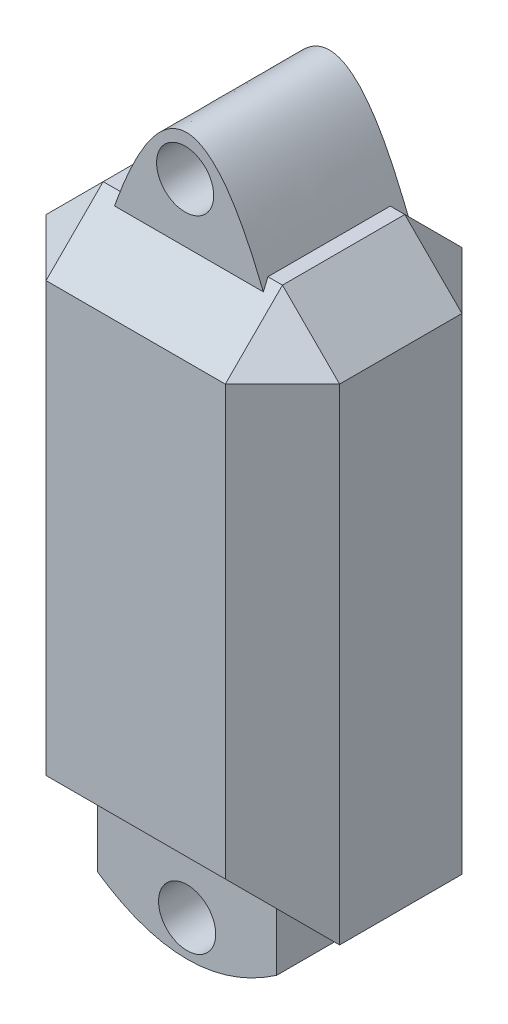
ISO-10303-21;
HEADER;
FILE_DESCRIPTION(('STEP AP214'),'2;1');
FILE_NAME('part.step','',(''),(''),'','','');
FILE_SCHEMA(('AUTOMOTIVE_DESIGN { 1 0 10303 214 1 1 1 1 }'));
ENDSEC;
DATA;
#1=APPLICATION_CONTEXT('core data for automotive mechanical design processes');
#2=APPLICATION_PROTOCOL_DEFINITION('international standard','automotive_design',2000,#1);
#3=PRODUCT_CONTEXT('',#1,'mechanical');
#4=PRODUCT('Part','Part','',(#3));
#5=PRODUCT_RELATED_PRODUCT_CATEGORY('part','',(#4));
#6=PRODUCT_DEFINITION_FORMATION('','',#4);
#7=PRODUCT_DEFINITION_CONTEXT('part definition',#1,'design');
#8=PRODUCT_DEFINITION('design','',#6,#7);
#9=PRODUCT_DEFINITION_SHAPE('','',#8);
#10=(LENGTH_UNIT() NAMED_UNIT(*) SI_UNIT(.MILLI.,.METRE.));
#11=(NAMED_UNIT(*) PLANE_ANGLE_UNIT() SI_UNIT($,.RADIAN.));
#12=(NAMED_UNIT(*) SI_UNIT($,.STERADIAN.) SOLID_ANGLE_UNIT());
#13=UNCERTAINTY_MEASURE_WITH_UNIT(LENGTH_MEASURE(1.E-05),#10,'distance_accuracy_value','');
#14=(GEOMETRIC_REPRESENTATION_CONTEXT(3) GLOBAL_UNCERTAINTY_ASSIGNED_CONTEXT((#13)) GLOBAL_UNIT_ASSIGNED_CONTEXT((#10,
#11,#12)) REPRESENTATION_CONTEXT('',''));
#15=CARTESIAN_POINT('',(0.,0.,0.));
#16=DIRECTION('',(0.,0.,1.));
#17=DIRECTION('',(1.,0.,0.));
#18=AXIS2_PLACEMENT_3D('',#15,#16,#17);
#19=CARTESIAN_POINT('',(0.,0.,0.));
#20=DIRECTION('',(0.,-1.,0.));
#21=DIRECTION('',(0.,0.,-1.));
#22=AXIS2_PLACEMENT_3D('',#19,#20,#21);
#23=PLANE('',#22);
#24=DIRECTION('',(0.,0.,-1.));
#25=VECTOR('',#24,1.);
#26=CARTESIAN_POINT('',(13.1377551020408,0.,25.));
#27=LINE('',#26,#25);
#28=CARTESIAN_POINT('',(13.1377551020408,0.,23.6525623301883));
#29=VERTEX_POINT('',#28);
#30=CARTESIAN_POINT('',(13.1377551020408,0.,2.24150356803531));
#31=VERTEX_POINT('',#30);
#32=EDGE_CURVE('E210',#29,#31,#27,.T.);
#33=ORIENTED_EDGE('',*,*,#32,.F.);
#34=DIRECTION('',(1.,0.,0.));
#35=VECTOR('',#34,1.);
#36=CARTESIAN_POINT('',(0.,0.,23.6525623301883));
#37=LINE('',#36,#35);
#38=CARTESIAN_POINT('',(15.6857053904163,0.,23.6525623301883));
#39=VERTEX_POINT('',#38);
#40=EDGE_CURVE('E432',#29,#39,#37,.T.);
#41=ORIENTED_EDGE('',*,*,#40,.T.);
#42=DIRECTION('',(0.,0.,-1.));
#43=VECTOR('',#42,1.);
#44=CARTESIAN_POINT('',(15.6857053904163,0.,0.));
#45=LINE('',#44,#43);
#46=CARTESIAN_POINT('',(15.6857053904163,0.,2.24150356803531));
#47=VERTEX_POINT('',#46);
#48=EDGE_CURVE('E444',#39,#47,#45,.T.);
#49=ORIENTED_EDGE('',*,*,#48,.T.);
#50=DIRECTION('',(-1.,0.,0.));
#51=VECTOR('',#50,1.);
#52=CARTESIAN_POINT('',(0.,0.,2.24150356803531));
#53=LINE('',#52,#51);
#54=EDGE_CURVE('E435',#47,#31,#53,.T.);
#55=ORIENTED_EDGE('',*,*,#54,.T.);
#56=EDGE_LOOP('',(#33,#41,#49,#55));
#57=FACE_BOUND('',#56,.T.);
#58=ADVANCED_FACE('F36',(#57),#23,.F.);
#59=CARTESIAN_POINT('',(0.,-95.,0.));
#60=DIRECTION('',(0.,-1.,0.));
#61=DIRECTION('',(0.,0.,-1.));
#62=AXIS2_PLACEMENT_3D('',#59,#60,#61);
#63=PLANE('',#62);
#64=DIRECTION('',(0.,0.,-1.));
#65=VECTOR('',#64,1.);
#66=CARTESIAN_POINT('',(-25.6857053904163,-95.,33.6525623301883));
#67=LINE('',#66,#65);
#68=CARTESIAN_POINT('',(-25.6857053904163,-95.,23.6525623301883));
#69=VERTEX_POINT('',#68);
#70=CARTESIAN_POINT('',(-25.6857053904163,-95.,2.24150356803531));
#71=VERTEX_POINT('',#70);
#72=EDGE_CURVE('E216',#69,#71,#67,.T.);
#73=ORIENTED_EDGE('',*,*,#72,.T.);
#74=DIRECTION('',(1.,0.,0.));
#75=VECTOR('',#74,1.);
#76=CARTESIAN_POINT('',(25.6857053904163,-95.,2.24150356803531));
#77=LINE('',#76,#75);
#78=CARTESIAN_POINT('',(-15.6857053904163,-95.,2.24150356803532));
#79=VERTEX_POINT('',#78);
#80=EDGE_CURVE('E508',#71,#79,#77,.T.);
#81=ORIENTED_EDGE('',*,*,#80,.T.);
#82=DIRECTION('',(0.,0.,-1.));
#83=VECTOR('',#82,1.);
#84=CARTESIAN_POINT('',(-15.6857053904163,-95.,116.241503568035));
#85=LINE('',#84,#83);
#86=CARTESIAN_POINT('',(-15.6857053904163,-95.,23.6525623301883));
#87=VERTEX_POINT('',#86);
#88=EDGE_CURVE('E357',#87,#79,#85,.T.);
#89=ORIENTED_EDGE('',*,*,#88,.F.);
#90=DIRECTION('',(-1.,0.,0.));
#91=VECTOR('',#90,1.);
#92=CARTESIAN_POINT('',(-25.6857053904163,-95.,23.6525623301883));
#93=LINE('',#92,#91);
#94=EDGE_CURVE('E207',#87,#69,#93,.T.);
#95=ORIENTED_EDGE('',*,*,#94,.T.);
#96=EDGE_LOOP('',(#73,#81,#89,#95));
#97=FACE_BOUND('',#96,.T.);
#98=ADVANCED_FACE('F394',(#97),#63,.T.);
#99=CARTESIAN_POINT('',(0.239838107216174,16.0909489745126,25.));
#100=DIRECTION('',(0.,0.,1.));
#101=DIRECTION('',(1.,0.,0.));
#102=AXIS2_PLACEMENT_3D('',#99,#100,#101);
#103=PLANE('',#102);
#104=CARTESIAN_POINT('',(544.971114688013,-1287.27591796101,25.));
#105=CARTESIAN_POINT('',(279.054434895027,-643.637958980505,25.));
#106=CARTESIAN_POINT('',(13.1377551020408,0.,25.));
#107=CARTESIAN_POINT('',(-0.158078887608479,32.1818979490252,25.));
#108=CARTESIAN_POINT('',(-11.8622448979592,0.,25.));
#109=CARTESIAN_POINT('',(-58.678908939362,-128.727591796101,25.));
#110=CARTESIAN_POINT('',(-105.495572980765,-257.455183592202,25.));
#111=B_SPLINE_CURVE_WITH_KNOTS('',2,(#104,#105,#106,#107,#108,#109,#110),.UNSPECIFIED.,.F.,.F.,
(3,2,2,3),(-20.,0.,1.,5.),.UNSPECIFIED.);
#112=CARTESIAN_POINT('',(13.6944440704041,-1.34743766981172,25.));
#113=VERTEX_POINT('',#112);
#114=CARTESIAN_POINT('',(-11.8622448979592,0.,25.));
#115=VERTEX_POINT('',#114);
#116=EDGE_CURVE('E227',#113,#115,#111,.T.);
#117=ORIENTED_EDGE('',*,*,#116,.T.);
#118=CARTESIAN_POINT('',(13.1377551020408,0.,25.));
#119=CARTESIAN_POINT('',(-0.158078887608479,32.1818979490252,25.));
#120=CARTESIAN_POINT('',(-11.8622448979592,0.,25.));
#121=CARTESIAN_POINT('',(-58.678908939362,-128.727591796101,25.));
#122=CARTESIAN_POINT('',(-105.495572980765,-257.455183592202,25.));
#123=B_SPLINE_CURVE_WITH_KNOTS('',2,(#118,#119,#120,#121,#122),.UNSPECIFIED.,.F.,.F.,(3,2,3),
(0.,1.,5.),.UNSPECIFIED.);
#124=CARTESIAN_POINT('',(-12.3522916379326,-1.34743766981172,25.));
#125=VERTEX_POINT('',#124);
#126=EDGE_CURVE('E45',#115,#125,#123,.T.);
#127=ORIENTED_EDGE('',*,*,#126,.T.);
#128=DIRECTION('',(-1.,0.,0.));
#129=VECTOR('',#128,1.);
#130=CARTESIAN_POINT('',(-25.6857053904163,-1.34743766981172,25.));
#131=LINE('',#130,#129);
#132=EDGE_CURVE('E472',#125,#113,#131,.F.);
#133=ORIENTED_EDGE('',*,*,#132,.T.);
#134=EDGE_LOOP('',(#117,#127,#133));
#135=FACE_BOUND('',#134,.T.);
#136=CARTESIAN_POINT('',(0.,8.90150617997449,25.));
#137=DIRECTION('',(0.,0.,1.));
#138=DIRECTION('',(1.,0.,0.));
#139=AXIS2_PLACEMENT_3D('',#136,#137,#138);
#140=CIRCLE('',#139,5.);
#141=CARTESIAN_POINT('',(5.,8.90150617997449,25.));
#142=VERTEX_POINT('',#141);
#143=EDGE_CURVE('E231',#142,#142,#140,.T.);
#144=ORIENTED_EDGE('',*,*,#143,.F.);
#145=EDGE_LOOP('',(#144));
#146=FACE_BOUND('',#145,.T.);
#147=ADVANCED_FACE('F416',(#135,#146),#103,.T.);
#148=CARTESIAN_POINT('',(0.239838107216174,16.0909489745126,0.));
#149=DIRECTION('',(0.,0.,1.));
#150=DIRECTION('',(1.,0.,0.));
#151=AXIS2_PLACEMENT_3D('',#148,#149,#150);
#152=PLANE('',#151);
#153=CARTESIAN_POINT('',(119.504427019235,-257.455183592202,0.));
#154=CARTESIAN_POINT('',(66.3210910606381,-128.727591796101,0.));
#155=CARTESIAN_POINT('',(13.1377551020408,0.,0.));
#156=CARTESIAN_POINT('',(-0.158078887608479,32.1818979490252,0.));
#157=CARTESIAN_POINT('',(-11.8622448979592,0.,0.));
#158=CARTESIAN_POINT('',(-245.945565104973,-643.637958980505,0.));
#159=CARTESIAN_POINT('',(-480.028885311987,-1287.27591796101,0.));
#160=B_SPLINE_CURVE_WITH_KNOTS('',2,(#153,#154,#155,#156,#157,#158,#159),.UNSPECIFIED.,.F.,.F.,
(3,2,2,3),(-4.,0.,1.,21.),.UNSPECIFIED.);
#161=CARTESIAN_POINT('',(13.1377551020408,0.,0.));
#162=VERTEX_POINT('',#161);
#163=CARTESIAN_POINT('',(-12.6774525626728,-2.24150356803531,0.));
#164=VERTEX_POINT('',#163);
#165=EDGE_CURVE('E53',#162,#164,#160,.T.);
#166=ORIENTED_EDGE('',*,*,#165,.F.);
#167=CARTESIAN_POINT('',(119.504427019235,-257.455183592202,0.));
#168=CARTESIAN_POINT('',(66.3210910606381,-128.727591796101,0.));
#169=CARTESIAN_POINT('',(13.1377551020408,0.,0.));
#170=CARTESIAN_POINT('',(-0.158078887608479,32.1818979490252,0.));
#171=CARTESIAN_POINT('',(-11.8622448979592,0.,0.));
#172=B_SPLINE_CURVE_WITH_KNOTS('',2,(#167,#168,#169,#170,#171),.UNSPECIFIED.,.F.,.F.,(3,2,3),
(-4.,0.,1.),.UNSPECIFIED.);
#173=CARTESIAN_POINT('',(14.0638241416919,-2.24150356803531,0.));
#174=VERTEX_POINT('',#173);
#175=EDGE_CURVE('E11',#162,#174,#172,.F.);
#176=ORIENTED_EDGE('',*,*,#175,.T.);
#177=DIRECTION('',(1.,0.,0.));
#178=VECTOR('',#177,1.);
#179=CARTESIAN_POINT('',(0.239838107216174,-2.24150356803531,0.));
#180=LINE('',#179,#178);
#181=EDGE_CURVE('E282',#174,#164,#180,.F.);
#182=ORIENTED_EDGE('',*,*,#181,.T.);
#183=EDGE_LOOP('',(#166,#176,#182));
#184=FACE_BOUND('',#183,.T.);
#185=CARTESIAN_POINT('',(0.,8.90150617997449,0.));
#186=DIRECTION('',(0.,0.,1.));
#187=DIRECTION('',(1.,0.,0.));
#188=AXIS2_PLACEMENT_3D('',#185,#186,#187);
#189=CIRCLE('',#188,5.);
#190=CARTESIAN_POINT('',(5.,8.90150617997449,0.));
#191=VERTEX_POINT('',#190);
#192=EDGE_CURVE('E240',#191,#191,#189,.T.);
#193=ORIENTED_EDGE('',*,*,#192,.T.);
#194=EDGE_LOOP('',(#193));
#195=FACE_BOUND('',#194,.T.);
#196=ADVANCED_FACE('F252',(#184,#195),#152,.F.);
#197=DIRECTION('',(0.,0.,-1.));
#198=VECTOR('',#197,1.);
#199=SURFACE_OF_LINEAR_EXTRUSION('',#111,#198);
#200=ORIENTED_EDGE('',*,*,#165,.T.);
#201=CARTESIAN_POINT('',(-12.6774525626728,-2.24150356803531,0.));
#202=CARTESIAN_POINT('',(-12.405716674435,-1.49433571202354,0.747167856011771));
#203=CARTESIAN_POINT('',(-12.1339807861971,-0.747167856011769,1.49433571202354));
#204=CARTESIAN_POINT('',(-11.8622448979592,0.,2.24150356803531));
#205=B_SPLINE_CURVE_WITH_KNOTS('',3,(#201,#202,#203,#204),.UNSPECIFIED.,.F.,.F.,(4,4),(0.,
3.27310861836847),.UNSPECIFIED.);
#206=CARTESIAN_POINT('',(-11.8622448979592,0.,2.24150356803531));
#207=VERTEX_POINT('',#206);
#208=EDGE_CURVE('E294',#164,#207,#205,.T.);
#209=ORIENTED_EDGE('',*,*,#208,.T.);
#210=DIRECTION('',(0.,0.,-1.));
#211=VECTOR('',#210,1.);
#212=CARTESIAN_POINT('',(-11.8622448979592,0.,25.));
#213=LINE('',#212,#211);
#214=CARTESIAN_POINT('',(-11.8622448979592,0.,23.6525623301883));
#215=VERTEX_POINT('',#214);
#216=EDGE_CURVE('E205',#215,#207,#213,.T.);
#217=ORIENTED_EDGE('',*,*,#216,.F.);
#218=CARTESIAN_POINT('',(-11.8622448979592,0.,23.6525623301883));
#219=CARTESIAN_POINT('',(-12.0255938112836,-0.44914588993724,24.1017082201255));
#220=CARTESIAN_POINT('',(-12.1889427246081,-0.89829177987448,24.5508541100628));
#221=CARTESIAN_POINT('',(-12.3522916379326,-1.34743766981172,25.));
#222=B_SPLINE_CURVE_WITH_KNOTS('',3,(#218,#219,#220,#221),.UNSPECIFIED.,.F.,.F.,(4,4),(0.,
1.96756762410186),.UNSPECIFIED.);
#223=EDGE_CURVE('E259',#215,#125,#222,.T.);
#224=ORIENTED_EDGE('',*,*,#223,.T.);
#225=ORIENTED_EDGE('',*,*,#126,.F.);
#226=ORIENTED_EDGE('',*,*,#116,.F.);
#227=CARTESIAN_POINT('',(13.6944440704041,-1.34743766981172,25.));
#228=CARTESIAN_POINT('',(13.5088810809497,-0.898291779874477,24.5508541100628));
#229=CARTESIAN_POINT('',(13.3233180914953,-0.449145889937239,24.1017082201255));
#230=CARTESIAN_POINT('',(13.1377551020408,0.,23.6525623301883));
#231=B_SPLINE_CURVE_WITH_KNOTS('',3,(#227,#228,#229,#230),.UNSPECIFIED.,.F.,.F.,(4,4),(0.,
1.98521514087332),.UNSPECIFIED.);
#232=EDGE_CURVE('E270',#113,#29,#231,.T.);
#233=ORIENTED_EDGE('',*,*,#232,.T.);
#234=ORIENTED_EDGE('',*,*,#32,.T.);
#235=CARTESIAN_POINT('',(13.1377551020408,0.,2.24150356803531));
#236=CARTESIAN_POINT('',(13.4464447819245,-0.747167856011769,1.49433571202354));
#237=CARTESIAN_POINT('',(13.7551344618082,-1.49433571202354,0.747167856011771));
#238=CARTESIAN_POINT('',(14.0638241416919,-2.24150356803531,0.));
#239=B_SPLINE_CURVE_WITH_KNOTS('',3,(#235,#236,#237,#238),.UNSPECIFIED.,.F.,.F.,(4,4),(0.,
3.30246579955499),.UNSPECIFIED.);
#240=EDGE_CURVE('E59',#31,#174,#239,.T.);
#241=ORIENTED_EDGE('',*,*,#240,.T.);
#242=ORIENTED_EDGE('',*,*,#175,.F.);
#243=EDGE_LOOP('',(#200,#209,#217,#224,#225,#226,#233,#234,#241,#242));
#244=FACE_BOUND('',#243,.T.);
#245=ADVANCED_FACE('F246',(#244),#199,.F.);
#246=CARTESIAN_POINT('',(0.,8.90150617997449,25.));
#247=DIRECTION('',(0.,0.,-1.));
#248=DIRECTION('',(-1.,0.,0.));
#249=AXIS2_PLACEMENT_3D('',#246,#247,#248);
#250=CYLINDRICAL_SURFACE('',#249,5.);
#251=ORIENTED_EDGE('',*,*,#143,.T.);
#252=EDGE_LOOP('',(#251));
#253=FACE_BOUND('',#252,.T.);
#254=ORIENTED_EDGE('',*,*,#192,.F.);
#255=EDGE_LOOP('',(#254));
#256=FACE_BOUND('',#255,.T.);
#257=ADVANCED_FACE('F251',(#253,#256),#250,.F.);
#258=DIRECTION('',(0.,0.,1.));
#259=VECTOR('',#258,1.);
#260=CARTESIAN_POINT('',(-15.6857053904163,0.,0.));
#261=LINE('',#260,#259);
#262=CARTESIAN_POINT('',(-15.6857053904163,0.,2.24150356803531));
#263=VERTEX_POINT('',#262);
#264=CARTESIAN_POINT('',(-15.6857053904163,0.,23.6525623301883));
#265=VERTEX_POINT('',#264);
#266=EDGE_CURVE('E480',#263,#265,#261,.T.);
#267=ORIENTED_EDGE('',*,*,#266,.T.);
#268=DIRECTION('',(1.,0.,0.));
#269=VECTOR('',#268,1.);
#270=CARTESIAN_POINT('',(0.,0.,23.6525623301883));
#271=LINE('',#270,#269);
#272=EDGE_CURVE('E477',#265,#215,#271,.T.);
#273=ORIENTED_EDGE('',*,*,#272,.T.);
#274=ORIENTED_EDGE('',*,*,#216,.T.);
#275=DIRECTION('',(-1.,0.,0.));
#276=VECTOR('',#275,1.);
#277=CARTESIAN_POINT('',(0.,0.,2.24150356803531));
#278=LINE('',#277,#276);
#279=EDGE_CURVE('E481',#207,#263,#278,.T.);
#280=ORIENTED_EDGE('',*,*,#279,.T.);
#281=EDGE_LOOP('',(#267,#273,#274,#280));
#282=FACE_BOUND('',#281,.T.);
#283=ADVANCED_FACE('F395',(#282),#23,.F.);
#284=CARTESIAN_POINT('',(25.6857053904163,-95.,33.6525623301883));
#285=DIRECTION('',(-1.,0.,0.));
#286=DIRECTION('',(0.,0.,1.));
#287=AXIS2_PLACEMENT_3D('',#284,#285,#286);
#288=PLANE('',#287);
#289=DIRECTION('',(0.,0.,1.));
#290=VECTOR('',#289,1.);
#291=CARTESIAN_POINT('',(25.6857053904163,-9.99999999999999,33.6525623301883));
#292=LINE('',#291,#290);
#293=CARTESIAN_POINT('',(25.6857053904163,-9.99999999999999,2.24150356803531));
#294=VERTEX_POINT('',#293);
#295=CARTESIAN_POINT('',(25.6857053904163,-9.99999999999999,23.6525623301883));
#296=VERTEX_POINT('',#295);
#297=EDGE_CURVE('E446',#294,#296,#292,.T.);
#298=ORIENTED_EDGE('',*,*,#297,.T.);
#299=DIRECTION('',(0.,-1.,0.));
#300=VECTOR('',#299,1.);
#301=CARTESIAN_POINT('',(25.6857053904163,-95.,23.6525623301883));
#302=LINE('',#301,#300);
#303=CARTESIAN_POINT('',(25.6857053904163,-95.,23.6525623301883));
#304=VERTEX_POINT('',#303);
#305=EDGE_CURVE('E452',#296,#304,#302,.T.);
#306=ORIENTED_EDGE('',*,*,#305,.T.);
#307=DIRECTION('',(0.,0.,1.));
#308=VECTOR('',#307,1.);
#309=CARTESIAN_POINT('',(25.6857053904163,-95.,33.6525623301883));
#310=LINE('',#309,#308);
#311=CARTESIAN_POINT('',(25.6857053904163,-95.,2.24150356803531));
#312=VERTEX_POINT('',#311);
#313=EDGE_CURVE('E374',#312,#304,#310,.T.);
#314=ORIENTED_EDGE('',*,*,#313,.F.);
#315=DIRECTION('',(0.,1.,0.));
#316=VECTOR('',#315,1.);
#317=CARTESIAN_POINT('',(25.6857053904163,-95.,2.24150356803531));
#318=LINE('',#317,#316);
#319=EDGE_CURVE('E443',#312,#294,#318,.T.);
#320=ORIENTED_EDGE('',*,*,#319,.T.);
#321=EDGE_LOOP('',(#298,#306,#314,#320));
#322=FACE_BOUND('',#321,.T.);
#323=ADVANCED_FACE('F398',(#322),#288,.F.);
#324=CARTESIAN_POINT('',(-25.6857053904163,-95.,33.6525623301883));
#325=DIRECTION('',(0.,0.,-1.));
#326=DIRECTION('',(-1.,0.,0.));
#327=AXIS2_PLACEMENT_3D('',#324,#325,#326);
#328=PLANE('',#327);
#329=DIRECTION('',(1.,0.,0.));
#330=VECTOR('',#329,1.);
#331=CARTESIAN_POINT('',(25.6857053904163,-85.,33.6525623301883));
#332=LINE('',#331,#330);
#333=CARTESIAN_POINT('',(-15.6857053904163,-85.,33.6525623301883));
#334=VERTEX_POINT('',#333);
#335=CARTESIAN_POINT('',(15.6857053904163,-85.,33.6525623301883));
#336=VERTEX_POINT('',#335);
#337=EDGE_CURVE('E492',#334,#336,#332,.T.);
#338=ORIENTED_EDGE('',*,*,#337,.T.);
#339=DIRECTION('',(0.,1.,0.));
#340=VECTOR('',#339,1.);
#341=CARTESIAN_POINT('',(15.6857053904163,-95.,33.6525623301883));
#342=LINE('',#341,#340);
#343=CARTESIAN_POINT('',(15.6857053904163,-9.99999999999999,33.6525623301883));
#344=VERTEX_POINT('',#343);
#345=EDGE_CURVE('E488',#336,#344,#342,.T.);
#346=ORIENTED_EDGE('',*,*,#345,.T.);
#347=DIRECTION('',(-1.,0.,0.));
#348=VECTOR('',#347,1.);
#349=CARTESIAN_POINT('',(-25.6857053904163,-9.99999999999999,33.6525623301883));
#350=LINE('',#349,#348);
#351=CARTESIAN_POINT('',(-15.6857053904163,-9.99999999999999,33.6525623301883));
#352=VERTEX_POINT('',#351);
#353=EDGE_CURVE('E495',#344,#352,#350,.T.);
#354=ORIENTED_EDGE('',*,*,#353,.T.);
#355=DIRECTION('',(0.,-1.,0.));
#356=VECTOR('',#355,1.);
#357=CARTESIAN_POINT('',(-15.6857053904163,-95.,33.6525623301883));
#358=LINE('',#357,#356);
#359=EDGE_CURVE('E497',#352,#334,#358,.T.);
#360=ORIENTED_EDGE('',*,*,#359,.T.);
#361=EDGE_LOOP('',(#338,#346,#354,#360));
#362=FACE_BOUND('',#361,.T.);
#363=ADVANCED_FACE('F406',(#362),#328,.F.);
#364=CARTESIAN_POINT('',(-25.6857053904163,-95.,33.6525623301883));
#365=DIRECTION('',(1.,0.,0.));
#366=DIRECTION('',(0.,0.,-1.));
#367=AXIS2_PLACEMENT_3D('',#364,#365,#366);
#368=PLANE('',#367);
#369=ORIENTED_EDGE('',*,*,#72,.F.);
#370=DIRECTION('',(0.,1.,0.));
#371=VECTOR('',#370,1.);
#372=CARTESIAN_POINT('',(-25.6857053904163,-95.,23.6525623301883));
#373=LINE('',#372,#371);
#374=CARTESIAN_POINT('',(-25.6857053904163,-10.,23.6525623301883));
#375=VERTEX_POINT('',#374);
#376=EDGE_CURVE('E458',#69,#375,#373,.T.);
#377=ORIENTED_EDGE('',*,*,#376,.T.);
#378=DIRECTION('',(0.,0.,-1.));
#379=VECTOR('',#378,1.);
#380=CARTESIAN_POINT('',(-25.6857053904163,-10.,33.6525623301883));
#381=LINE('',#380,#379);
#382=CARTESIAN_POINT('',(-25.6857053904163,-10.,2.24150356803531));
#383=VERTEX_POINT('',#382);
#384=EDGE_CURVE('E456',#375,#383,#381,.T.);
#385=ORIENTED_EDGE('',*,*,#384,.T.);
#386=DIRECTION('',(0.,-1.,0.));
#387=VECTOR('',#386,1.);
#388=CARTESIAN_POINT('',(-25.6857053904163,-95.,2.24150356803531));
#389=LINE('',#388,#387);
#390=EDGE_CURVE('E454',#383,#71,#389,.T.);
#391=ORIENTED_EDGE('',*,*,#390,.T.);
#392=EDGE_LOOP('',(#369,#377,#385,#391));
#393=FACE_BOUND('',#392,.T.);
#394=ADVANCED_FACE('F402',(#393),#368,.F.);
#395=CARTESIAN_POINT('',(-25.6857053904163,-95.,-7.75849643196471));
#396=DIRECTION('',(0.,0.,1.));
#397=DIRECTION('',(1.,0.,0.));
#398=AXIS2_PLACEMENT_3D('',#395,#396,#397);
#399=PLANE('',#398);
#400=DIRECTION('',(0.,-1.,0.));
#401=VECTOR('',#400,1.);
#402=CARTESIAN_POINT('',(15.6857053904163,-95.,-7.75849643196471));
#403=LINE('',#402,#401);
#404=CARTESIAN_POINT('',(15.6857053904163,-9.99999999999999,-7.75849643196471));
#405=VERTEX_POINT('',#404);
#406=CARTESIAN_POINT('',(15.6857053904163,-85.,-7.75849643196471));
#407=VERTEX_POINT('',#406);
#408=EDGE_CURVE('E502',#405,#407,#403,.T.);
#409=ORIENTED_EDGE('',*,*,#408,.T.);
#410=DIRECTION('',(-1.,0.,0.));
#411=VECTOR('',#410,1.);
#412=CARTESIAN_POINT('',(-25.6857053904163,-85.,-7.75849643196471));
#413=LINE('',#412,#411);
#414=CARTESIAN_POINT('',(-15.6857053904163,-85.,-7.75849643196471));
#415=VERTEX_POINT('',#414);
#416=EDGE_CURVE('E499',#407,#415,#413,.T.);
#417=ORIENTED_EDGE('',*,*,#416,.T.);
#418=DIRECTION('',(0.,1.,0.));
#419=VECTOR('',#418,1.);
#420=CARTESIAN_POINT('',(-15.6857053904163,-95.,-7.75849643196471));
#421=LINE('',#420,#419);
#422=CARTESIAN_POINT('',(-15.6857053904163,-9.99999999999999,-7.75849643196471));
#423=VERTEX_POINT('',#422);
#424=EDGE_CURVE('E506',#415,#423,#421,.T.);
#425=ORIENTED_EDGE('',*,*,#424,.T.);
#426=DIRECTION('',(1.,0.,0.));
#427=VECTOR('',#426,1.);
#428=CARTESIAN_POINT('',(-25.6857053904163,-9.99999999999999,-7.75849643196471));
#429=LINE('',#428,#427);
#430=EDGE_CURVE('E504',#423,#405,#429,.T.);
#431=ORIENTED_EDGE('',*,*,#430,.T.);
#432=EDGE_LOOP('',(#409,#417,#425,#431));
#433=FACE_BOUND('',#432,.T.);
#434=ADVANCED_FACE('F392',(#433),#399,.F.);
#435=DIRECTION('',(0.,0.,-1.));
#436=VECTOR('',#435,1.);
#437=CARTESIAN_POINT('',(15.6857053904163,-95.,116.241503568035));
#438=LINE('',#437,#436);
#439=CARTESIAN_POINT('',(15.6857053904163,-95.,23.6525623301883));
#440=VERTEX_POINT('',#439);
#441=CARTESIAN_POINT('',(15.6857053904163,-95.,2.24150356803532));
#442=VERTEX_POINT('',#441);
#443=EDGE_CURVE('E190',#440,#442,#438,.T.);
#444=ORIENTED_EDGE('',*,*,#443,.T.);
#445=DIRECTION('',(1.,0.,0.));
#446=VECTOR('',#445,1.);
#447=CARTESIAN_POINT('',(25.6857053904163,-95.,2.24150356803531));
#448=LINE('',#447,#446);
#449=EDGE_CURVE('E511',#442,#312,#448,.T.);
#450=ORIENTED_EDGE('',*,*,#449,.T.);
#451=ORIENTED_EDGE('',*,*,#313,.T.);
#452=DIRECTION('',(-1.,0.,0.));
#453=VECTOR('',#452,1.);
#454=CARTESIAN_POINT('',(-25.6857053904163,-95.,23.6525623301883));
#455=LINE('',#454,#453);
#456=EDGE_CURVE('E513',#304,#440,#455,.T.);
#457=ORIENTED_EDGE('',*,*,#456,.T.);
#458=EDGE_LOOP('',(#444,#450,#451,#457));
#459=FACE_BOUND('',#458,.T.);
#460=ADVANCED_FACE('F388',(#459),#63,.T.);
#461=CARTESIAN_POINT('',(25.6857053904163,-95.,33.2415035680352));
#462=CARTESIAN_POINT('',(0.,-124.013272893745,33.2415035680352));
#463=CARTESIAN_POINT('',(-25.6857053904163,-95.,33.2415035680352));
#464=B_SPLINE_CURVE_WITH_KNOTS('',2,(#461,#462,#463),.UNSPECIFIED.,.F.,.F.,(3,3),(0.,1.),.UNSPECIFIED.);
#465=DIRECTION('',(0.,0.,-1.));
#466=VECTOR('',#465,1.);
#467=SURFACE_OF_LINEAR_EXTRUSION('',#464,#466);
#468=DIRECTION('',(0.,0.,-1.));
#469=VECTOR('',#468,1.);
#470=CARTESIAN_POINT('',(15.6857053904163,-104.096704015383,12.9470329491118));
#471=LINE('',#470,#469);
#472=CARTESIAN_POINT('',(15.6857053904163,-104.096704015383,24.6525623301883));
#473=VERTEX_POINT('',#472);
#474=CARTESIAN_POINT('',(15.6857053904163,-104.096704015383,1.24150356803529));
#475=VERTEX_POINT('',#474);
#476=EDGE_CURVE('E370',#473,#475,#471,.T.);
#477=ORIENTED_EDGE('',*,*,#476,.F.);
#478=CARTESIAN_POINT('',(25.6857053904163,-95.,24.6525623301883));
#479=CARTESIAN_POINT('',(0.,-124.013272893745,24.6525623301883));
#480=CARTESIAN_POINT('',(-25.6857053904163,-95.,24.6525623301883));
#481=B_SPLINE_CURVE_WITH_KNOTS('',2,(#478,#479,#480),.UNSPECIFIED.,.F.,.F.,(3,3),(0.,1.),.UNSPECIFIED.);
#482=CARTESIAN_POINT('',(-15.6857053904163,-104.096704015383,24.6525623301883));
#483=VERTEX_POINT('',#482);
#484=EDGE_CURVE('E199',#483,#473,#481,.F.);
#485=ORIENTED_EDGE('',*,*,#484,.F.);
#486=DIRECTION('',(0.,0.,-1.));
#487=VECTOR('',#486,1.);
#488=CARTESIAN_POINT('',(-15.6857053904163,-104.096704015383,12.9470329491118));
#489=LINE('',#488,#487);
#490=CARTESIAN_POINT('',(-15.6857053904163,-104.096704015383,1.24150356803529));
#491=VERTEX_POINT('',#490);
#492=EDGE_CURVE('E182',#491,#483,#489,.F.);
#493=ORIENTED_EDGE('',*,*,#492,.F.);
#494=CARTESIAN_POINT('',(25.6857053904163,-95.,1.24150356803529));
#495=CARTESIAN_POINT('',(0.,-124.013272893745,1.24150356803529));
#496=CARTESIAN_POINT('',(-25.6857053904163,-95.,1.24150356803529));
#497=B_SPLINE_CURVE_WITH_KNOTS('',2,(#494,#495,#496),.UNSPECIFIED.,.F.,.F.,(3,3),(0.,1.),.UNSPECIFIED.);
#498=EDGE_CURVE('E197',#475,#491,#497,.T.);
#499=ORIENTED_EDGE('',*,*,#498,.F.);
#500=EDGE_LOOP('',(#477,#485,#493,#499));
#501=FACE_BOUND('',#500,.T.);
#502=ADVANCED_FACE('F196',(#501),#467,.T.);
#503=CARTESIAN_POINT('',(-98.3142946095836,-95.,24.6525623301883));
#504=DIRECTION('',(0.,0.,-1.));
#505=DIRECTION('',(-1.,0.,0.));
#506=AXIS2_PLACEMENT_3D('',#503,#504,#505);
#507=PLANE('',#506);
#508=CARTESIAN_POINT('',(0.,-103.202814895375,24.6525623301883));
#509=DIRECTION('',(0.,0.,1.));
#510=DIRECTION('',(1.,0.,0.));
#511=AXIS2_PLACEMENT_3D('',#508,#509,#510);
#512=CIRCLE('',#511,5.);
#513=CARTESIAN_POINT('',(5.,-103.202814895375,24.6525623301883));
#514=VERTEX_POINT('',#513);
#515=EDGE_CURVE('E578',#514,#514,#512,.T.);
#516=ORIENTED_EDGE('',*,*,#515,.F.);
#517=EDGE_LOOP('',(#516));
#518=FACE_BOUND('',#517,.T.);
#519=ORIENTED_EDGE('',*,*,#484,.T.);
#520=DIRECTION('',(0.,1.,0.));
#521=VECTOR('',#520,1.);
#522=CARTESIAN_POINT('',(15.6857053904163,-95.,24.6525623301883));
#523=LINE('',#522,#521);
#524=CARTESIAN_POINT('',(15.6857053904163,-94.,24.6525623301883));
#525=VERTEX_POINT('',#524);
#526=EDGE_CURVE('E372',#473,#525,#523,.T.);
#527=ORIENTED_EDGE('',*,*,#526,.T.);
#528=DIRECTION('',(-1.,0.,0.));
#529=VECTOR('',#528,1.);
#530=CARTESIAN_POINT('',(-98.3142946095836,-94.,24.6525623301883));
#531=LINE('',#530,#529);
#532=CARTESIAN_POINT('',(-15.6857053904163,-94.,24.6525623301883));
#533=VERTEX_POINT('',#532);
#534=EDGE_CURVE('E468',#525,#533,#531,.T.);
#535=ORIENTED_EDGE('',*,*,#534,.T.);
#536=DIRECTION('',(0.,-1.,0.));
#537=VECTOR('',#536,1.);
#538=CARTESIAN_POINT('',(-15.6857053904163,-95.,24.6525623301883));
#539=LINE('',#538,#537);
#540=EDGE_CURVE('E200',#533,#483,#539,.T.);
#541=ORIENTED_EDGE('',*,*,#540,.T.);
#542=EDGE_LOOP('',(#519,#527,#535,#541));
#543=FACE_BOUND('',#542,.T.);
#544=ADVANCED_FACE('F387',(#518,#543),#507,.F.);
#545=CARTESIAN_POINT('',(-98.3142946095836,-95.,1.24150356803529));
#546=DIRECTION('',(0.,0.,1.));
#547=DIRECTION('',(0.,-1.,0.));
#548=AXIS2_PLACEMENT_3D('',#545,#546,#547);
#549=PLANE('',#548);
#550=CARTESIAN_POINT('',(0.,-103.202814895375,1.24150356803529));
#551=DIRECTION('',(0.,0.,1.));
#552=DIRECTION('',(0.,-1.,0.));
#553=AXIS2_PLACEMENT_3D('',#550,#551,#552);
#554=CIRCLE('',#553,5.);
#555=CARTESIAN_POINT('',(0.,-108.202814895375,1.24150356803529));
#556=VERTEX_POINT('',#555);
#557=EDGE_CURVE('E40',#556,#556,#554,.T.);
#558=ORIENTED_EDGE('',*,*,#557,.T.);
#559=EDGE_LOOP('',(#558));
#560=FACE_BOUND('',#559,.T.);
#561=DIRECTION('',(0.,1.,0.));
#562=VECTOR('',#561,1.);
#563=CARTESIAN_POINT('',(-15.6857053904163,-95.,1.24150356803529));
#564=LINE('',#563,#562);
#565=CARTESIAN_POINT('',(-15.6857053904163,-94.,1.24150356803529));
#566=VERTEX_POINT('',#565);
#567=EDGE_CURVE('E179',#491,#566,#564,.T.);
#568=ORIENTED_EDGE('',*,*,#567,.T.);
#569=DIRECTION('',(1.,0.,0.));
#570=VECTOR('',#569,1.);
#571=CARTESIAN_POINT('',(-98.3142946095836,-94.,1.24150356803529));
#572=LINE('',#571,#570);
#573=CARTESIAN_POINT('',(15.6857053904163,-94.,1.24150356803529));
#574=VERTEX_POINT('',#573);
#575=EDGE_CURVE('E461',#566,#574,#572,.T.);
#576=ORIENTED_EDGE('',*,*,#575,.T.);
#577=DIRECTION('',(0.,-1.,0.));
#578=VECTOR('',#577,1.);
#579=CARTESIAN_POINT('',(15.6857053904163,-95.,1.24150356803529));
#580=LINE('',#579,#578);
#581=EDGE_CURVE('E204',#574,#475,#580,.T.);
#582=ORIENTED_EDGE('',*,*,#581,.T.);
#583=ORIENTED_EDGE('',*,*,#498,.T.);
#584=EDGE_LOOP('',(#568,#576,#582,#583));
#585=FACE_BOUND('',#584,.T.);
#586=ADVANCED_FACE('F203',(#560,#585),#549,.F.);
#587=CARTESIAN_POINT('',(-15.6857053904163,-95.,116.241503568035));
#588=DIRECTION('',(1.,0.,0.));
#589=DIRECTION('',(0.,0.,-1.));
#590=AXIS2_PLACEMENT_3D('',#587,#588,#589);
#591=PLANE('',#590);
#592=ORIENTED_EDGE('',*,*,#540,.F.);
#593=DIRECTION('',(0.,-0.707106781186549,-0.707106781186547));
#594=VECTOR('',#593,1.);
#595=CARTESIAN_POINT('',(-15.6857053904163,-48.7055293810765,69.9470329491116));
#596=LINE('',#595,#594);
#597=EDGE_CURVE('E470',#533,#87,#596,.T.);
#598=ORIENTED_EDGE('',*,*,#597,.T.);
#599=ORIENTED_EDGE('',*,*,#88,.T.);
#600=DIRECTION('',(0.,0.707106781186547,-0.707106781186549));
#601=VECTOR('',#600,1.);
#602=CARTESIAN_POINT('',(-15.6857053904163,-152.,59.2415035680354));
#603=LINE('',#602,#601);
#604=EDGE_CURVE('E185',#79,#566,#603,.T.);
#605=ORIENTED_EDGE('',*,*,#604,.T.);
#606=ORIENTED_EDGE('',*,*,#567,.F.);
#607=ORIENTED_EDGE('',*,*,#492,.T.);
#608=EDGE_LOOP('',(#592,#598,#599,#605,#606,#607));
#609=FACE_BOUND('',#608,.T.);
#610=ADVANCED_FACE('F181',(#609),#591,.F.);
#611=CARTESIAN_POINT('',(15.6857053904163,-95.,116.241503568035));
#612=DIRECTION('',(-1.,0.,0.));
#613=DIRECTION('',(0.,0.,1.));
#614=AXIS2_PLACEMENT_3D('',#611,#612,#613);
#615=PLANE('',#614);
#616=ORIENTED_EDGE('',*,*,#476,.T.);
#617=ORIENTED_EDGE('',*,*,#581,.F.);
#618=DIRECTION('',(0.,-0.707106781186547,0.707106781186549));
#619=VECTOR('',#618,1.);
#620=CARTESIAN_POINT('',(15.6857053904163,-152.,59.2415035680354));
#621=LINE('',#620,#619);
#622=EDGE_CURVE('E463',#574,#442,#621,.T.);
#623=ORIENTED_EDGE('',*,*,#622,.T.);
#624=ORIENTED_EDGE('',*,*,#443,.F.);
#625=DIRECTION('',(0.,0.707106781186549,0.707106781186547));
#626=VECTOR('',#625,1.);
#627=CARTESIAN_POINT('',(15.6857053904163,-48.7055293810765,69.9470329491116));
#628=LINE('',#627,#626);
#629=EDGE_CURVE('E465',#440,#525,#628,.T.);
#630=ORIENTED_EDGE('',*,*,#629,.T.);
#631=ORIENTED_EDGE('',*,*,#526,.F.);
#632=EDGE_LOOP('',(#616,#617,#623,#624,#630,#631));
#633=FACE_BOUND('',#632,.T.);
#634=ADVANCED_FACE('F540',(#633),#615,.F.);
#635=CARTESIAN_POINT('',(0.,-95.,23.6525623301883));
#636=DIRECTION('',(0.,-0.707106781186546,0.707106781186548));
#637=DIRECTION('',(1.,0.,0.));
#638=AXIS2_PLACEMENT_3D('',#635,#636,#637);
#639=PLANE('',#638);
#640=DIRECTION('',(-0.577350269189624,0.577350269189627,0.577350269189626));
#641=VECTOR('',#640,1.);
#642=CARTESIAN_POINT('',(19.0190387237497,-88.3333333333333,30.319228996855));
#643=LINE('',#642,#641);
#644=EDGE_CURVE('E353',#336,#304,#643,.F.);
#645=ORIENTED_EDGE('',*,*,#644,.F.);
#646=ORIENTED_EDGE('',*,*,#337,.F.);
#647=DIRECTION('',(-0.577350269189624,-0.577350269189627,-0.577350269189626));
#648=VECTOR('',#647,1.);
#649=CARTESIAN_POINT('',(-25.6857053904163,-95.,23.6525623301883));
#650=LINE('',#649,#648);
#651=EDGE_CURVE('E355',#69,#334,#650,.F.);
#652=ORIENTED_EDGE('',*,*,#651,.F.);
#653=ORIENTED_EDGE('',*,*,#94,.F.);
#654=ORIENTED_EDGE('',*,*,#597,.F.);
#655=ORIENTED_EDGE('',*,*,#534,.F.);
#656=ORIENTED_EDGE('',*,*,#629,.F.);
#657=ORIENTED_EDGE('',*,*,#456,.F.);
#658=EDGE_LOOP('',(#645,#646,#652,#653,#654,#655,#656,#657));
#659=FACE_BOUND('',#658,.T.);
#660=ADVANCED_FACE('F38',(#659),#639,.T.);
#661=CARTESIAN_POINT('',(-25.6857053904163,-95.,23.6525623301883));
#662=DIRECTION('',(0.707106781186548,0.,-0.707106781186546));
#663=DIRECTION('',(0.,1.,0.));
#664=AXIS2_PLACEMENT_3D('',#661,#662,#663);
#665=PLANE('',#664);
#666=ORIENTED_EDGE('',*,*,#651,.T.);
#667=ORIENTED_EDGE('',*,*,#359,.F.);
#668=DIRECTION('',(-0.707106781186546,0.,-0.707106781186548));
#669=VECTOR('',#668,1.);
#670=CARTESIAN_POINT('',(-15.6857053904163,-10.,33.6525623301883));
#671=LINE('',#670,#669);
#672=EDGE_CURVE('E347',#375,#352,#671,.F.);
#673=ORIENTED_EDGE('',*,*,#672,.F.);
#674=ORIENTED_EDGE('',*,*,#376,.F.);
#675=EDGE_LOOP('',(#666,#667,#673,#674));
#676=FACE_BOUND('',#675,.T.);
#677=ADVANCED_FACE('F555',(#676),#665,.F.);
#678=CARTESIAN_POINT('',(15.6857053904163,-95.,33.6525623301883));
#679=DIRECTION('',(-0.707106781186548,0.,-0.707106781186546));
#680=DIRECTION('',(0.,1.,0.));
#681=AXIS2_PLACEMENT_3D('',#678,#679,#680);
#682=PLANE('',#681);
#683=ORIENTED_EDGE('',*,*,#644,.T.);
#684=ORIENTED_EDGE('',*,*,#305,.F.);
#685=DIRECTION('',(-0.707106781186546,0.,0.707106781186548));
#686=VECTOR('',#685,1.);
#687=CARTESIAN_POINT('',(20.6857053904163,-10.,28.6525623301883));
#688=LINE('',#687,#686);
#689=EDGE_CURVE('E344',#344,#296,#688,.F.);
#690=ORIENTED_EDGE('',*,*,#689,.F.);
#691=ORIENTED_EDGE('',*,*,#345,.F.);
#692=EDGE_LOOP('',(#683,#684,#690,#691));
#693=FACE_BOUND('',#692,.T.);
#694=ADVANCED_FACE('F548',(#693),#682,.F.);
#695=CARTESIAN_POINT('',(-25.6857053904163,-9.99999999999999,33.6525623301883));
#696=DIRECTION('',(0.,-0.707106781186548,-0.707106781186546));
#697=DIRECTION('',(-1.,0.,0.));
#698=AXIS2_PLACEMENT_3D('',#695,#696,#697);
#699=PLANE('',#698);
#700=DIRECTION('',(0.,-0.707106781186546,0.707106781186548));
#701=VECTOR('',#700,1.);
#702=CARTESIAN_POINT('',(-15.6857053904163,-9.99999999999999,33.6525623301883));
#703=LINE('',#702,#701);
#704=EDGE_CURVE('E350',#352,#265,#703,.F.);
#705=ORIENTED_EDGE('',*,*,#704,.F.);
#706=ORIENTED_EDGE('',*,*,#353,.F.);
#707=DIRECTION('',(0.,0.707106781186546,-0.707106781186548));
#708=VECTOR('',#707,1.);
#709=CARTESIAN_POINT('',(15.6857053904163,0.,23.6525623301883));
#710=LINE('',#709,#708);
#711=EDGE_CURVE('E341',#39,#344,#710,.F.);
#712=ORIENTED_EDGE('',*,*,#711,.F.);
#713=ORIENTED_EDGE('',*,*,#40,.F.);
#714=ORIENTED_EDGE('',*,*,#232,.F.);
#715=ORIENTED_EDGE('',*,*,#132,.F.);
#716=ORIENTED_EDGE('',*,*,#223,.F.);
#717=ORIENTED_EDGE('',*,*,#272,.F.);
#718=EDGE_LOOP('',(#705,#706,#712,#713,#714,#715,#716,#717));
#719=FACE_BOUND('',#718,.T.);
#720=ADVANCED_FACE('F439',(#719),#699,.F.);
#721=CARTESIAN_POINT('',(-15.6857053904163,-9.99999999999999,33.6525623301883));
#722=DIRECTION('',(-0.577350269189627,0.577350269189626,0.577350269189624));
#723=DIRECTION('',(-0.707106781186547,-0.707106781186548,0.));
#724=AXIS2_PLACEMENT_3D('',#721,#722,#723);
#725=PLANE('',#724);
#726=ORIENTED_EDGE('',*,*,#672,.T.);
#727=ORIENTED_EDGE('',*,*,#704,.T.);
#728=DIRECTION('',(0.707106781186547,0.707106781186548,0.));
#729=VECTOR('',#728,1.);
#730=CARTESIAN_POINT('',(-20.6857053904163,-5.00000000000001,23.6525623301883));
#731=LINE('',#730,#729);
#732=EDGE_CURVE('E338',#375,#265,#731,.T.);
#733=ORIENTED_EDGE('',*,*,#732,.F.);
#734=EDGE_LOOP('',(#726,#727,#733));
#735=FACE_BOUND('',#734,.T.);
#736=ADVANCED_FACE('F553',(#735),#725,.T.);
#737=CARTESIAN_POINT('',(15.6857053904163,0.,23.6525623301883));
#738=DIRECTION('',(0.577350269189626,0.577350269189627,0.577350269189624));
#739=DIRECTION('',(-0.707106781186548,0.707106781186547,0.));
#740=AXIS2_PLACEMENT_3D('',#737,#738,#739);
#741=PLANE('',#740);
#742=ORIENTED_EDGE('',*,*,#711,.T.);
#743=ORIENTED_EDGE('',*,*,#689,.T.);
#744=DIRECTION('',(0.707106781186548,-0.707106781186547,0.));
#745=VECTOR('',#744,1.);
#746=CARTESIAN_POINT('',(15.6857053904163,0.,23.6525623301883));
#747=LINE('',#746,#745);
#748=EDGE_CURVE('E335',#39,#296,#747,.T.);
#749=ORIENTED_EDGE('',*,*,#748,.F.);
#750=EDGE_LOOP('',(#742,#743,#749));
#751=FACE_BOUND('',#750,.T.);
#752=ADVANCED_FACE('F606',(#751),#741,.T.);
#753=CARTESIAN_POINT('',(-25.6857053904163,-10.,33.6525623301883));
#754=DIRECTION('',(0.707106781186548,-0.707106781186546,0.));
#755=DIRECTION('',(0.,0.,-1.));
#756=AXIS2_PLACEMENT_3D('',#753,#754,#755);
#757=PLANE('',#756);
#758=ORIENTED_EDGE('',*,*,#732,.T.);
#759=ORIENTED_EDGE('',*,*,#266,.F.);
#760=DIRECTION('',(-0.707106781186547,-0.707106781186548,0.));
#761=VECTOR('',#760,1.);
#762=CARTESIAN_POINT('',(-15.6857053904163,0.,2.24150356803531));
#763=LINE('',#762,#761);
#764=EDGE_CURVE('E329',#383,#263,#763,.F.);
#765=ORIENTED_EDGE('',*,*,#764,.F.);
#766=ORIENTED_EDGE('',*,*,#384,.F.);
#767=EDGE_LOOP('',(#758,#759,#765,#766));
#768=FACE_BOUND('',#767,.T.);
#769=ADVANCED_FACE('F608',(#768),#757,.F.);
#770=CARTESIAN_POINT('',(25.6857053904163,-9.99999999999999,33.6525623301883));
#771=DIRECTION('',(-0.707106781186546,-0.707106781186548,0.));
#772=DIRECTION('',(0.,0.,1.));
#773=AXIS2_PLACEMENT_3D('',#770,#771,#772);
#774=PLANE('',#773);
#775=ORIENTED_EDGE('',*,*,#748,.T.);
#776=ORIENTED_EDGE('',*,*,#297,.F.);
#777=DIRECTION('',(-0.707106781186549,0.707106781186546,0.));
#778=VECTOR('',#777,1.);
#779=CARTESIAN_POINT('',(15.6857053904163,0.,2.24150356803531));
#780=LINE('',#779,#778);
#781=EDGE_CURVE('E326',#47,#294,#780,.F.);
#782=ORIENTED_EDGE('',*,*,#781,.F.);
#783=ORIENTED_EDGE('',*,*,#48,.F.);
#784=EDGE_LOOP('',(#775,#776,#782,#783));
#785=FACE_BOUND('',#784,.T.);
#786=ADVANCED_FACE('F289',(#785),#774,.F.);
#787=CARTESIAN_POINT('',(-25.6857053904163,-9.99999999999999,-7.75849643196471));
#788=DIRECTION('',(0.,-0.707106781186548,0.707106781186546));
#789=DIRECTION('',(1.,0.,0.));
#790=AXIS2_PLACEMENT_3D('',#787,#788,#789);
#791=PLANE('',#790);
#792=DIRECTION('',(0.,0.707106781186546,0.707106781186548));
#793=VECTOR('',#792,1.);
#794=CARTESIAN_POINT('',(-15.6857053904163,0.,2.24150356803531));
#795=LINE('',#794,#793);
#796=EDGE_CURVE('E332',#263,#423,#795,.F.);
#797=ORIENTED_EDGE('',*,*,#796,.F.);
#798=ORIENTED_EDGE('',*,*,#279,.F.);
#799=ORIENTED_EDGE('',*,*,#208,.F.);
#800=ORIENTED_EDGE('',*,*,#181,.F.);
#801=ORIENTED_EDGE('',*,*,#240,.F.);
#802=ORIENTED_EDGE('',*,*,#54,.F.);
#803=DIRECTION('',(0.,-0.707106781186547,-0.707106781186549));
#804=VECTOR('',#803,1.);
#805=CARTESIAN_POINT('',(15.6857053904163,0.,2.24150356803531));
#806=LINE('',#805,#804);
#807=EDGE_CURVE('E323',#405,#47,#806,.F.);
#808=ORIENTED_EDGE('',*,*,#807,.F.);
#809=ORIENTED_EDGE('',*,*,#430,.F.);
#810=EDGE_LOOP('',(#797,#798,#799,#800,#801,#802,#808,#809));
#811=FACE_BOUND('',#810,.T.);
#812=ADVANCED_FACE('F283',(#811),#791,.F.);
#813=CARTESIAN_POINT('',(-15.6857053904163,0.,2.24150356803531));
#814=DIRECTION('',(-0.577350269189627,0.577350269189626,-0.577350269189624));
#815=DIRECTION('',(-0.707106781186547,-0.707106781186548,0.));
#816=AXIS2_PLACEMENT_3D('',#813,#814,#815);
#817=PLANE('',#816);
#818=ORIENTED_EDGE('',*,*,#764,.T.);
#819=ORIENTED_EDGE('',*,*,#796,.T.);
#820=DIRECTION('',(0.707106781186546,0.,-0.707106781186548));
#821=VECTOR('',#820,1.);
#822=CARTESIAN_POINT('',(-20.6857053904163,-10.,-2.7584964319647));
#823=LINE('',#822,#821);
#824=EDGE_CURVE('E320',#383,#423,#823,.T.);
#825=ORIENTED_EDGE('',*,*,#824,.F.);
#826=EDGE_LOOP('',(#818,#819,#825));
#827=FACE_BOUND('',#826,.T.);
#828=ADVANCED_FACE('F288',(#827),#817,.T.);
#829=CARTESIAN_POINT('',(15.6857053904163,0.,2.24150356803531));
#830=DIRECTION('',(0.577350269189626,0.577350269189627,-0.577350269189624));
#831=DIRECTION('',(-0.707106781186549,0.707106781186546,0.));
#832=AXIS2_PLACEMENT_3D('',#829,#830,#831);
#833=PLANE('',#832);
#834=ORIENTED_EDGE('',*,*,#807,.T.);
#835=ORIENTED_EDGE('',*,*,#781,.T.);
#836=DIRECTION('',(0.707106781186546,0.,0.707106781186548));
#837=VECTOR('',#836,1.);
#838=CARTESIAN_POINT('',(20.6857053904163,-10.,-2.7584964319647));
#839=LINE('',#838,#837);
#840=EDGE_CURVE('E317',#405,#294,#839,.T.);
#841=ORIENTED_EDGE('',*,*,#840,.F.);
#842=EDGE_LOOP('',(#834,#835,#841));
#843=FACE_BOUND('',#842,.T.);
#844=ADVANCED_FACE('F588',(#843),#833,.T.);
#845=CARTESIAN_POINT('',(-15.6857053904163,-95.,-7.75849643196471));
#846=DIRECTION('',(0.707106781186548,0.,0.707106781186546));
#847=DIRECTION('',(0.,1.,0.));
#848=AXIS2_PLACEMENT_3D('',#845,#846,#847);
#849=PLANE('',#848);
#850=ORIENTED_EDGE('',*,*,#824,.T.);
#851=ORIENTED_EDGE('',*,*,#424,.F.);
#852=DIRECTION('',(0.577350269189625,0.577350269189625,-0.577350269189627));
#853=VECTOR('',#852,1.);
#854=CARTESIAN_POINT('',(-19.0190387237496,-88.3333333333333,-4.42516309863138));
#855=LINE('',#854,#853);
#856=EDGE_CURVE('E315',#71,#415,#855,.T.);
#857=ORIENTED_EDGE('',*,*,#856,.F.);
#858=ORIENTED_EDGE('',*,*,#390,.F.);
#859=EDGE_LOOP('',(#850,#851,#857,#858));
#860=FACE_BOUND('',#859,.T.);
#861=ADVANCED_FACE('F533',(#860),#849,.F.);
#862=CARTESIAN_POINT('',(25.6857053904163,-95.,2.24150356803531));
#863=DIRECTION('',(-0.707106781186548,0.,0.707106781186546));
#864=DIRECTION('',(0.,1.,0.));
#865=AXIS2_PLACEMENT_3D('',#862,#863,#864);
#866=PLANE('',#865);
#867=ORIENTED_EDGE('',*,*,#840,.T.);
#868=ORIENTED_EDGE('',*,*,#319,.F.);
#869=DIRECTION('',(0.577350269189625,-0.577350269189625,0.577350269189627));
#870=VECTOR('',#869,1.);
#871=CARTESIAN_POINT('',(25.6857053904163,-95.,2.24150356803531));
#872=LINE('',#871,#870);
#873=EDGE_CURVE('E309',#407,#312,#872,.T.);
#874=ORIENTED_EDGE('',*,*,#873,.F.);
#875=ORIENTED_EDGE('',*,*,#408,.F.);
#876=EDGE_LOOP('',(#867,#868,#874,#875));
#877=FACE_BOUND('',#876,.T.);
#878=ADVANCED_FACE('F575',(#877),#866,.F.);
#879=CARTESIAN_POINT('',(0.,-95.,2.24150356803531));
#880=DIRECTION('',(0.,-0.707106781186548,-0.707106781186546));
#881=DIRECTION('',(-1.,0.,0.));
#882=AXIS2_PLACEMENT_3D('',#879,#880,#881);
#883=PLANE('',#882);
#884=ORIENTED_EDGE('',*,*,#856,.T.);
#885=ORIENTED_EDGE('',*,*,#416,.F.);
#886=ORIENTED_EDGE('',*,*,#873,.T.);
#887=ORIENTED_EDGE('',*,*,#449,.F.);
#888=ORIENTED_EDGE('',*,*,#622,.F.);
#889=ORIENTED_EDGE('',*,*,#575,.F.);
#890=ORIENTED_EDGE('',*,*,#604,.F.);
#891=ORIENTED_EDGE('',*,*,#80,.F.);
#892=EDGE_LOOP('',(#884,#885,#886,#887,#888,#889,#890,#891));
#893=FACE_BOUND('',#892,.T.);
#894=ADVANCED_FACE('F254',(#893),#883,.T.);
#895=CARTESIAN_POINT('',(0.,-103.202814895375,-58.3474376698117));
#896=DIRECTION('',(0.,0.,1.));
#897=DIRECTION('',(1.,0.,0.));
#898=AXIS2_PLACEMENT_3D('',#895,#896,#897);
#899=CYLINDRICAL_SURFACE('',#898,5.);
#900=ORIENTED_EDGE('',*,*,#515,.T.);
#901=EDGE_LOOP('',(#900));
#902=FACE_BOUND('',#901,.T.);
#903=ORIENTED_EDGE('',*,*,#557,.F.);
#904=EDGE_LOOP('',(#903));
#905=FACE_BOUND('',#904,.T.);
#906=ADVANCED_FACE('F569',(#902,#905),#899,.F.);
#907=CLOSED_SHELL('',(#58,#98,#147,#196,#245,#257,#283,#323,#363,#394,#434,#460,#502,#544,#586,
#610,#634,#660,#677,#694,#720,#736,#752,#769,#786,#812,#828,#844,#861,#878,#894,#906));
#908=MANIFOLD_SOLID_BREP('B2',#907);
#909=ADVANCED_BREP_SHAPE_REPRESENTATION('',(#18,#908),#14);
#910=SHAPE_DEFINITION_REPRESENTATION(#9,#909);
ENDSEC;
END-ISO-10303-21;
